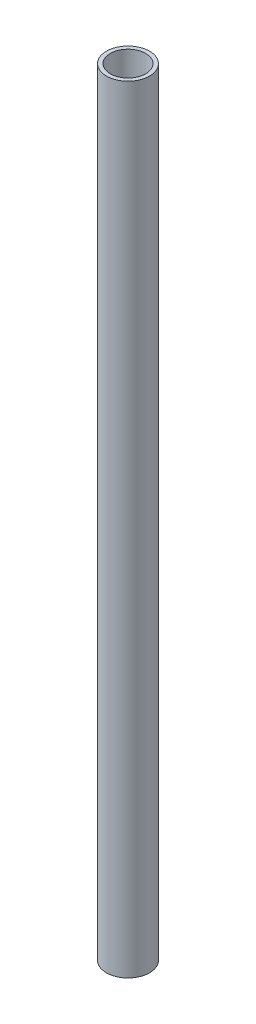
ISO-10303-21;
HEADER;
FILE_DESCRIPTION(('STEP AP214'),'2;1');
FILE_NAME('part.step','',(''),(''),'','','');
FILE_SCHEMA(('AUTOMOTIVE_DESIGN { 1 0 10303 214 1 1 1 1 }'));
ENDSEC;
DATA;
#1=APPLICATION_CONTEXT('core data for automotive mechanical design processes');
#2=APPLICATION_PROTOCOL_DEFINITION('international standard','automotive_design',2000,#1);
#3=PRODUCT_CONTEXT('',#1,'mechanical');
#4=PRODUCT('Part','Part','',(#3));
#5=PRODUCT_RELATED_PRODUCT_CATEGORY('part','',(#4));
#6=PRODUCT_DEFINITION_FORMATION('','',#4);
#7=PRODUCT_DEFINITION_CONTEXT('part definition',#1,'design');
#8=PRODUCT_DEFINITION('design','',#6,#7);
#9=PRODUCT_DEFINITION_SHAPE('','',#8);
#10=(LENGTH_UNIT() NAMED_UNIT(*) SI_UNIT(.MILLI.,.METRE.));
#11=(NAMED_UNIT(*) PLANE_ANGLE_UNIT() SI_UNIT($,.RADIAN.));
#12=(NAMED_UNIT(*) SI_UNIT($,.STERADIAN.) SOLID_ANGLE_UNIT());
#13=UNCERTAINTY_MEASURE_WITH_UNIT(LENGTH_MEASURE(1.E-05),#10,'distance_accuracy_value','');
#14=(GEOMETRIC_REPRESENTATION_CONTEXT(3) GLOBAL_UNCERTAINTY_ASSIGNED_CONTEXT((#13)) GLOBAL_UNIT_ASSIGNED_CONTEXT((#10,
#11,#12)) REPRESENTATION_CONTEXT('',''));
#15=CARTESIAN_POINT('',(0.,0.,0.));
#16=DIRECTION('',(0.,0.,1.));
#17=DIRECTION('',(1.,0.,0.));
#18=AXIS2_PLACEMENT_3D('',#15,#16,#17);
#19=CARTESIAN_POINT('',(0.,457.2,0.));
#20=DIRECTION('',(0.,1.,0.));
#21=DIRECTION('',(0.,0.,1.));
#22=AXIS2_PLACEMENT_3D('',#19,#20,#21);
#23=PLANE('',#22);
#24=CARTESIAN_POINT('',(0.,457.2,0.));
#25=DIRECTION('',(0.,1.,0.));
#26=DIRECTION('',(0.,0.,1.));
#27=AXIS2_PLACEMENT_3D('',#24,#25,#26);
#28=CIRCLE('',#27,12.7);
#29=CARTESIAN_POINT('',(0.,457.2,12.7));
#30=VERTEX_POINT('',#29);
#31=EDGE_CURVE('E10',#30,#30,#28,.T.);
#32=ORIENTED_EDGE('',*,*,#31,.T.);
#33=EDGE_LOOP('',(#32));
#34=FACE_BOUND('',#33,.T.);
#35=CARTESIAN_POINT('',(0.,457.2,0.));
#36=DIRECTION('',(0.,1.,0.));
#37=DIRECTION('',(0.,0.,1.));
#38=AXIS2_PLACEMENT_3D('',#35,#36,#37);
#39=CIRCLE('',#38,10.414);
#40=CARTESIAN_POINT('',(0.,457.2,10.414));
#41=VERTEX_POINT('',#40);
#42=EDGE_CURVE('E42',#41,#41,#39,.T.);
#43=ORIENTED_EDGE('',*,*,#42,.F.);
#44=EDGE_LOOP('',(#43));
#45=FACE_BOUND('',#44,.T.);
#46=ADVANCED_FACE('F31',(#34,#45),#23,.T.);
#47=CARTESIAN_POINT('',(0.,0.,0.));
#48=DIRECTION('',(0.,1.,0.));
#49=DIRECTION('',(0.,0.,1.));
#50=AXIS2_PLACEMENT_3D('',#47,#48,#49);
#51=PLANE('',#50);
#52=CARTESIAN_POINT('',(0.,0.,0.));
#53=DIRECTION('',(0.,1.,0.));
#54=DIRECTION('',(0.,0.,1.));
#55=AXIS2_PLACEMENT_3D('',#52,#53,#54);
#56=CIRCLE('',#55,12.7);
#57=CARTESIAN_POINT('',(0.,0.,12.7));
#58=VERTEX_POINT('',#57);
#59=EDGE_CURVE('E35',#58,#58,#56,.T.);
#60=ORIENTED_EDGE('',*,*,#59,.F.);
#61=EDGE_LOOP('',(#60));
#62=FACE_BOUND('',#61,.T.);
#63=CARTESIAN_POINT('',(0.,0.,0.));
#64=DIRECTION('',(0.,1.,0.));
#65=DIRECTION('',(0.,0.,1.));
#66=AXIS2_PLACEMENT_3D('',#63,#64,#65);
#67=CIRCLE('',#66,10.414);
#68=CARTESIAN_POINT('',(0.,0.,10.414));
#69=VERTEX_POINT('',#68);
#70=EDGE_CURVE('E44',#69,#69,#67,.T.);
#71=ORIENTED_EDGE('',*,*,#70,.T.);
#72=EDGE_LOOP('',(#71));
#73=FACE_BOUND('',#72,.T.);
#74=ADVANCED_FACE('F54',(#62,#73),#51,.F.);
#75=CARTESIAN_POINT('',(0.,457.2,0.));
#76=DIRECTION('',(0.,-1.,0.));
#77=DIRECTION('',(0.,0.,-1.));
#78=AXIS2_PLACEMENT_3D('',#75,#76,#77);
#79=CYLINDRICAL_SURFACE('',#78,12.7);
#80=ORIENTED_EDGE('',*,*,#31,.F.);
#81=EDGE_LOOP('',(#80));
#82=FACE_BOUND('',#81,.T.);
#83=ORIENTED_EDGE('',*,*,#59,.T.);
#84=EDGE_LOOP('',(#83));
#85=FACE_BOUND('',#84,.T.);
#86=ADVANCED_FACE('F33',(#82,#85),#79,.T.);
#87=CARTESIAN_POINT('',(0.,457.2,0.));
#88=DIRECTION('',(0.,-1.,0.));
#89=DIRECTION('',(0.,0.,-1.));
#90=AXIS2_PLACEMENT_3D('',#87,#88,#89);
#91=CYLINDRICAL_SURFACE('',#90,10.414);
#92=ORIENTED_EDGE('',*,*,#42,.T.);
#93=EDGE_LOOP('',(#92));
#94=FACE_BOUND('',#93,.T.);
#95=ORIENTED_EDGE('',*,*,#70,.F.);
#96=EDGE_LOOP('',(#95));
#97=FACE_BOUND('',#96,.T.);
#98=ADVANCED_FACE('F50',(#94,#97),#91,.F.);
#99=CLOSED_SHELL('',(#46,#74,#86,#98));
#100=MANIFOLD_SOLID_BREP('B2',#99);
#101=ADVANCED_BREP_SHAPE_REPRESENTATION('',(#18,#100),#14);
#102=SHAPE_DEFINITION_REPRESENTATION(#9,#101);
ENDSEC;
END-ISO-10303-21;
